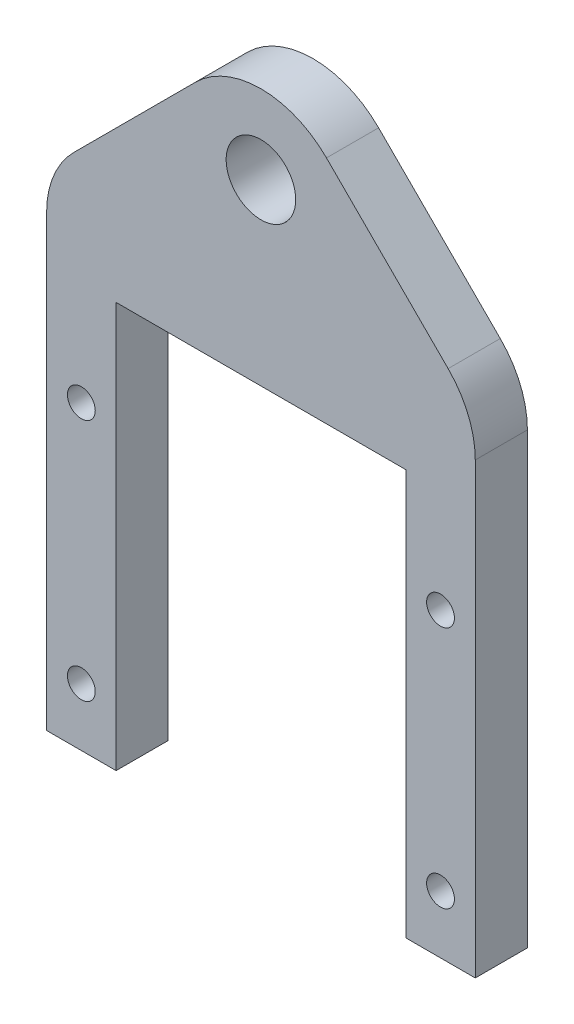
ISO-10303-21;
HEADER;
FILE_DESCRIPTION(('STEP AP214'),'2;1');
FILE_NAME('part.step','',(''),(''),'','','');
FILE_SCHEMA(('AUTOMOTIVE_DESIGN { 1 0 10303 214 1 1 1 1 }'));
ENDSEC;
DATA;
#1=APPLICATION_CONTEXT('core data for automotive mechanical design processes');
#2=APPLICATION_PROTOCOL_DEFINITION('international standard','automotive_design',2000,#1);
#3=PRODUCT_CONTEXT('',#1,'mechanical');
#4=PRODUCT('Part','Part','',(#3));
#5=PRODUCT_RELATED_PRODUCT_CATEGORY('part','',(#4));
#6=PRODUCT_DEFINITION_FORMATION('','',#4);
#7=PRODUCT_DEFINITION_CONTEXT('part definition',#1,'design');
#8=PRODUCT_DEFINITION('design','',#6,#7);
#9=PRODUCT_DEFINITION_SHAPE('','',#8);
#10=(LENGTH_UNIT() NAMED_UNIT(*) SI_UNIT(.MILLI.,.METRE.));
#11=(NAMED_UNIT(*) PLANE_ANGLE_UNIT() SI_UNIT($,.RADIAN.));
#12=(NAMED_UNIT(*) SI_UNIT($,.STERADIAN.) SOLID_ANGLE_UNIT());
#13=UNCERTAINTY_MEASURE_WITH_UNIT(LENGTH_MEASURE(1.E-05),#10,'distance_accuracy_value','');
#14=(GEOMETRIC_REPRESENTATION_CONTEXT(3) GLOBAL_UNCERTAINTY_ASSIGNED_CONTEXT((#13)) GLOBAL_UNIT_ASSIGNED_CONTEXT((#10,
#11,#12)) REPRESENTATION_CONTEXT('',''));
#15=CARTESIAN_POINT('',(0.,0.,0.));
#16=DIRECTION('',(0.,0.,1.));
#17=DIRECTION('',(1.,0.,0.));
#18=AXIS2_PLACEMENT_3D('',#15,#16,#17);
#19=CARTESIAN_POINT('',(0.,0.,4.5));
#20=DIRECTION('',(0.,0.,-1.));
#21=DIRECTION('',(-1.,0.,0.));
#22=AXIS2_PLACEMENT_3D('',#19,#20,#21);
#23=PLANE('',#22);
#24=DIRECTION('',(-0.707106781186547,-0.707106781186548,0.));
#25=VECTOR('',#24,1.);
#26=CARTESIAN_POINT('',(-18.5,42.034916596463,4.5));
#27=LINE('',#26,#25);
#28=CARTESIAN_POINT('',(-5.65685424949239,54.8780623469706,4.5));
#29=VERTEX_POINT('',#28);
#30=CARTESIAN_POINT('',(-16.1568542494924,44.3780623469706,4.5));
#31=VERTEX_POINT('',#30);
#32=EDGE_CURVE('E227',#29,#31,#27,.T.);
#33=ORIENTED_EDGE('',*,*,#32,.T.);
#34=CARTESIAN_POINT('',(-10.5,38.7212080974782,4.5));
#35=DIRECTION('',(0.,0.,-1.));
#36=DIRECTION('',(-1.,0.,0.));
#37=AXIS2_PLACEMENT_3D('',#34,#35,#36);
#38=CIRCLE('',#37,8.);
#39=CARTESIAN_POINT('',(-18.5,38.7212080974782,4.5));
#40=VERTEX_POINT('',#39);
#41=EDGE_CURVE('E172',#31,#40,#38,.F.);
#42=ORIENTED_EDGE('',*,*,#41,.T.);
#43=DIRECTION('',(0.,-1.,0.));
#44=VECTOR('',#43,1.);
#45=CARTESIAN_POINT('',(-18.5,0.,4.5));
#46=LINE('',#45,#44);
#47=CARTESIAN_POINT('',(-18.5,0.,4.5));
#48=VERTEX_POINT('',#47);
#49=EDGE_CURVE('E225',#40,#48,#46,.T.);
#50=ORIENTED_EDGE('',*,*,#49,.T.);
#51=DIRECTION('',(1.,0.,0.));
#52=VECTOR('',#51,1.);
#53=CARTESIAN_POINT('',(-12.5,0.,4.5));
#54=LINE('',#53,#52);
#55=CARTESIAN_POINT('',(-12.5,0.,4.5));
#56=VERTEX_POINT('',#55);
#57=EDGE_CURVE('E141',#48,#56,#54,.T.);
#58=ORIENTED_EDGE('',*,*,#57,.T.);
#59=DIRECTION('',(0.,1.,0.));
#60=VECTOR('',#59,1.);
#61=CARTESIAN_POINT('',(-12.5,0.,4.5));
#62=LINE('',#61,#60);
#63=CARTESIAN_POINT('',(-12.5,35.,4.5));
#64=VERTEX_POINT('',#63);
#65=EDGE_CURVE('E135',#56,#64,#62,.T.);
#66=ORIENTED_EDGE('',*,*,#65,.T.);
#67=DIRECTION('',(1.,0.,0.));
#68=VECTOR('',#67,1.);
#69=CARTESIAN_POINT('',(-12.5,35.,4.5));
#70=LINE('',#69,#68);
#71=CARTESIAN_POINT('',(12.5,35.,4.5));
#72=VERTEX_POINT('',#71);
#73=EDGE_CURVE('E125',#64,#72,#70,.T.);
#74=ORIENTED_EDGE('',*,*,#73,.T.);
#75=DIRECTION('',(0.,-1.,0.));
#76=VECTOR('',#75,1.);
#77=CARTESIAN_POINT('',(12.5,0.,4.5));
#78=LINE('',#77,#76);
#79=CARTESIAN_POINT('',(12.5,0.,4.5));
#80=VERTEX_POINT('',#79);
#81=EDGE_CURVE('E134',#72,#80,#78,.T.);
#82=ORIENTED_EDGE('',*,*,#81,.T.);
#83=DIRECTION('',(1.,0.,0.));
#84=VECTOR('',#83,1.);
#85=CARTESIAN_POINT('',(18.5,0.,4.5));
#86=LINE('',#85,#84);
#87=CARTESIAN_POINT('',(18.5,0.,4.5));
#88=VERTEX_POINT('',#87);
#89=EDGE_CURVE('E214',#80,#88,#86,.T.);
#90=ORIENTED_EDGE('',*,*,#89,.T.);
#91=DIRECTION('',(0.,1.,0.));
#92=VECTOR('',#91,1.);
#93=CARTESIAN_POINT('',(18.5,42.034916596463,4.5));
#94=LINE('',#93,#92);
#95=CARTESIAN_POINT('',(18.5,38.7212080974782,4.5));
#96=VERTEX_POINT('',#95);
#97=EDGE_CURVE('E230',#88,#96,#94,.T.);
#98=ORIENTED_EDGE('',*,*,#97,.T.);
#99=CARTESIAN_POINT('',(10.5,38.7212080974782,4.5));
#100=DIRECTION('',(0.,0.,-1.));
#101=DIRECTION('',(-1.,0.,0.));
#102=AXIS2_PLACEMENT_3D('',#99,#100,#101);
#103=CIRCLE('',#102,8.);
#104=CARTESIAN_POINT('',(16.1568542494924,44.3780623469706,4.5));
#105=VERTEX_POINT('',#104);
#106=EDGE_CURVE('E57',#96,#105,#103,.F.);
#107=ORIENTED_EDGE('',*,*,#106,.T.);
#108=DIRECTION('',(-0.707106781186547,0.707106781186548,0.));
#109=VECTOR('',#108,1.);
#110=CARTESIAN_POINT('',(0.,60.534916596463,4.5));
#111=LINE('',#110,#109);
#112=CARTESIAN_POINT('',(5.65685424949239,54.8780623469706,4.5));
#113=VERTEX_POINT('',#112);
#114=EDGE_CURVE('E179',#105,#113,#111,.T.);
#115=ORIENTED_EDGE('',*,*,#114,.T.);
#116=CARTESIAN_POINT('',(0.,49.2212080974782,4.5));
#117=DIRECTION('',(0.,0.,-1.));
#118=DIRECTION('',(-1.,0.,0.));
#119=AXIS2_PLACEMENT_3D('',#116,#117,#118);
#120=CIRCLE('',#119,8.);
#121=EDGE_CURVE('E169',#113,#29,#120,.F.);
#122=ORIENTED_EDGE('',*,*,#121,.T.);
#123=EDGE_LOOP('',(#33,#42,#50,#58,#66,#74,#82,#90,#98,#107,#115,#122));
#124=FACE_BOUND('',#123,.T.);
#125=CARTESIAN_POINT('',(-15.5,26.,4.5));
#126=DIRECTION('',(0.,0.,1.));
#127=DIRECTION('',(1.,0.,0.));
#128=AXIS2_PLACEMENT_3D('',#125,#126,#127);
#129=CIRCLE('',#128,1.2);
#130=CARTESIAN_POINT('',(-14.3,26.,4.5));
#131=VERTEX_POINT('',#130);
#132=EDGE_CURVE('E223',#131,#131,#129,.T.);
#133=ORIENTED_EDGE('',*,*,#132,.F.);
#134=EDGE_LOOP('',(#133));
#135=FACE_BOUND('',#134,.T.);
#136=CARTESIAN_POINT('',(-15.5,5.,4.5));
#137=DIRECTION('',(0.,0.,1.));
#138=DIRECTION('',(1.,0.,0.));
#139=AXIS2_PLACEMENT_3D('',#136,#137,#138);
#140=CIRCLE('',#139,1.2);
#141=CARTESIAN_POINT('',(-14.3,5.,4.5));
#142=VERTEX_POINT('',#141);
#143=EDGE_CURVE('E237',#142,#142,#140,.T.);
#144=ORIENTED_EDGE('',*,*,#143,.F.);
#145=EDGE_LOOP('',(#144));
#146=FACE_BOUND('',#145,.T.);
#147=CARTESIAN_POINT('',(15.5,5.,4.5));
#148=DIRECTION('',(0.,0.,1.));
#149=DIRECTION('',(-1.,0.,0.));
#150=AXIS2_PLACEMENT_3D('',#147,#148,#149);
#151=CIRCLE('',#150,1.2);
#152=CARTESIAN_POINT('',(14.3,5.,4.5));
#153=VERTEX_POINT('',#152);
#154=EDGE_CURVE('E243',#153,#153,#151,.T.);
#155=ORIENTED_EDGE('',*,*,#154,.F.);
#156=EDGE_LOOP('',(#155));
#157=FACE_BOUND('',#156,.T.);
#158=CARTESIAN_POINT('',(0.,50.4213975565305,4.5));
#159=DIRECTION('',(0.,0.,1.));
#160=DIRECTION('',(1.,0.,0.));
#161=AXIS2_PLACEMENT_3D('',#158,#159,#160);
#162=CIRCLE('',#161,3.);
#163=CARTESIAN_POINT('',(3.,50.4213975565305,4.5));
#164=VERTEX_POINT('',#163);
#165=EDGE_CURVE('E249',#164,#164,#162,.T.);
#166=ORIENTED_EDGE('',*,*,#165,.F.);
#167=EDGE_LOOP('',(#166));
#168=FACE_BOUND('',#167,.T.);
#169=CARTESIAN_POINT('',(15.5,26.,4.5));
#170=DIRECTION('',(0.,0.,1.));
#171=DIRECTION('',(-1.,0.,0.));
#172=AXIS2_PLACEMENT_3D('',#169,#170,#171);
#173=CIRCLE('',#172,1.2);
#174=CARTESIAN_POINT('',(14.3,26.,4.5));
#175=VERTEX_POINT('',#174);
#176=EDGE_CURVE('E255',#175,#175,#173,.T.);
#177=ORIENTED_EDGE('',*,*,#176,.F.);
#178=EDGE_LOOP('',(#177));
#179=FACE_BOUND('',#178,.T.);
#180=ADVANCED_FACE('F35',(#124,#135,#146,#157,#168,#179),#23,.F.);
#181=CARTESIAN_POINT('',(0.,0.,0.));
#182=DIRECTION('',(0.,0.,-1.));
#183=DIRECTION('',(-1.,0.,0.));
#184=AXIS2_PLACEMENT_3D('',#181,#182,#183);
#185=PLANE('',#184);
#186=CARTESIAN_POINT('',(0.,50.4213975565305,0.));
#187=DIRECTION('',(0.,0.,1.));
#188=DIRECTION('',(1.,0.,0.));
#189=AXIS2_PLACEMENT_3D('',#186,#187,#188);
#190=CIRCLE('',#189,3.);
#191=CARTESIAN_POINT('',(3.,50.4213975565305,0.));
#192=VERTEX_POINT('',#191);
#193=EDGE_CURVE('E252',#192,#192,#190,.T.);
#194=ORIENTED_EDGE('',*,*,#193,.T.);
#195=EDGE_LOOP('',(#194));
#196=FACE_BOUND('',#195,.T.);
#197=CARTESIAN_POINT('',(-15.5,5.,0.));
#198=DIRECTION('',(0.,0.,1.));
#199=DIRECTION('',(1.,0.,0.));
#200=AXIS2_PLACEMENT_3D('',#197,#198,#199);
#201=CIRCLE('',#200,1.2);
#202=CARTESIAN_POINT('',(-14.3,5.,0.));
#203=VERTEX_POINT('',#202);
#204=EDGE_CURVE('E240',#203,#203,#201,.T.);
#205=ORIENTED_EDGE('',*,*,#204,.T.);
#206=EDGE_LOOP('',(#205));
#207=FACE_BOUND('',#206,.T.);
#208=DIRECTION('',(0.,-1.,0.));
#209=VECTOR('',#208,1.);
#210=CARTESIAN_POINT('',(-18.5,0.,0.));
#211=LINE('',#210,#209);
#212=CARTESIAN_POINT('',(-18.5,38.7212080974782,0.));
#213=VERTEX_POINT('',#212);
#214=CARTESIAN_POINT('',(-18.5,0.,0.));
#215=VERTEX_POINT('',#214);
#216=EDGE_CURVE('E192',#213,#215,#211,.T.);
#217=ORIENTED_EDGE('',*,*,#216,.F.);
#218=CARTESIAN_POINT('',(-10.5,38.7212080974782,0.));
#219=DIRECTION('',(0.,0.,-1.));
#220=DIRECTION('',(-1.,0.,0.));
#221=AXIS2_PLACEMENT_3D('',#218,#219,#220);
#222=CIRCLE('',#221,8.);
#223=CARTESIAN_POINT('',(-16.1568542494924,44.3780623469706,0.));
#224=VERTEX_POINT('',#223);
#225=EDGE_CURVE('E162',#213,#224,#222,.T.);
#226=ORIENTED_EDGE('',*,*,#225,.T.);
#227=DIRECTION('',(-0.707106781186547,-0.707106781186548,0.));
#228=VECTOR('',#227,1.);
#229=CARTESIAN_POINT('',(-18.5,42.034916596463,0.));
#230=LINE('',#229,#228);
#231=CARTESIAN_POINT('',(-5.65685424949239,54.8780623469706,0.));
#232=VERTEX_POINT('',#231);
#233=EDGE_CURVE('E188',#232,#224,#230,.T.);
#234=ORIENTED_EDGE('',*,*,#233,.F.);
#235=CARTESIAN_POINT('',(0.,49.2212080974782,0.));
#236=DIRECTION('',(0.,0.,-1.));
#237=DIRECTION('',(-1.,0.,0.));
#238=AXIS2_PLACEMENT_3D('',#235,#236,#237);
#239=CIRCLE('',#238,8.);
#240=CARTESIAN_POINT('',(5.65685424949239,54.8780623469706,0.));
#241=VERTEX_POINT('',#240);
#242=EDGE_CURVE('E153',#232,#241,#239,.T.);
#243=ORIENTED_EDGE('',*,*,#242,.T.);
#244=DIRECTION('',(-0.707106781186547,0.707106781186548,0.));
#245=VECTOR('',#244,1.);
#246=CARTESIAN_POINT('',(0.,60.534916596463,0.));
#247=LINE('',#246,#245);
#248=CARTESIAN_POINT('',(16.1568542494924,44.3780623469706,0.));
#249=VERTEX_POINT('',#248);
#250=EDGE_CURVE('E178',#249,#241,#247,.T.);
#251=ORIENTED_EDGE('',*,*,#250,.F.);
#252=CARTESIAN_POINT('',(10.5,38.7212080974782,0.));
#253=DIRECTION('',(0.,0.,-1.));
#254=DIRECTION('',(-1.,0.,0.));
#255=AXIS2_PLACEMENT_3D('',#252,#253,#254);
#256=CIRCLE('',#255,8.);
#257=CARTESIAN_POINT('',(18.5,38.7212080974782,0.));
#258=VERTEX_POINT('',#257);
#259=EDGE_CURVE('E160',#249,#258,#256,.T.);
#260=ORIENTED_EDGE('',*,*,#259,.T.);
#261=DIRECTION('',(0.,1.,0.));
#262=VECTOR('',#261,1.);
#263=CARTESIAN_POINT('',(18.5,42.034916596463,0.));
#264=LINE('',#263,#262);
#265=CARTESIAN_POINT('',(18.5,0.,0.));
#266=VERTEX_POINT('',#265);
#267=EDGE_CURVE('E189',#266,#258,#264,.T.);
#268=ORIENTED_EDGE('',*,*,#267,.F.);
#269=DIRECTION('',(1.,0.,0.));
#270=VECTOR('',#269,1.);
#271=CARTESIAN_POINT('',(18.5,0.,0.));
#272=LINE('',#271,#270);
#273=CARTESIAN_POINT('',(12.5,0.,0.));
#274=VERTEX_POINT('',#273);
#275=EDGE_CURVE('E194',#274,#266,#272,.T.);
#276=ORIENTED_EDGE('',*,*,#275,.F.);
#277=DIRECTION('',(0.,-1.,0.));
#278=VECTOR('',#277,1.);
#279=CARTESIAN_POINT('',(12.5,0.,0.));
#280=LINE('',#279,#278);
#281=CARTESIAN_POINT('',(12.5,35.,0.));
#282=VERTEX_POINT('',#281);
#283=EDGE_CURVE('E217',#282,#274,#280,.T.);
#284=ORIENTED_EDGE('',*,*,#283,.F.);
#285=DIRECTION('',(1.,0.,0.));
#286=VECTOR('',#285,1.);
#287=CARTESIAN_POINT('',(-12.5,35.,0.));
#288=LINE('',#287,#286);
#289=CARTESIAN_POINT('',(-12.5,35.,0.));
#290=VERTEX_POINT('',#289);
#291=EDGE_CURVE('E218',#290,#282,#288,.T.);
#292=ORIENTED_EDGE('',*,*,#291,.F.);
#293=DIRECTION('',(0.,1.,0.));
#294=VECTOR('',#293,1.);
#295=CARTESIAN_POINT('',(-12.5,0.,0.));
#296=LINE('',#295,#294);
#297=CARTESIAN_POINT('',(-12.5,0.,0.));
#298=VERTEX_POINT('',#297);
#299=EDGE_CURVE('E149',#298,#290,#296,.T.);
#300=ORIENTED_EDGE('',*,*,#299,.F.);
#301=DIRECTION('',(1.,0.,0.));
#302=VECTOR('',#301,1.);
#303=CARTESIAN_POINT('',(-12.5,0.,0.));
#304=LINE('',#303,#302);
#305=EDGE_CURVE('E145',#215,#298,#304,.T.);
#306=ORIENTED_EDGE('',*,*,#305,.F.);
#307=EDGE_LOOP('',(#217,#226,#234,#243,#251,#260,#268,#276,#284,#292,#300,#306));
#308=FACE_BOUND('',#307,.T.);
#309=CARTESIAN_POINT('',(-15.5,26.,0.));
#310=DIRECTION('',(0.,0.,1.));
#311=DIRECTION('',(1.,0.,0.));
#312=AXIS2_PLACEMENT_3D('',#309,#310,#311);
#313=CIRCLE('',#312,1.2);
#314=CARTESIAN_POINT('',(-14.3,26.,0.));
#315=VERTEX_POINT('',#314);
#316=EDGE_CURVE('E234',#315,#315,#313,.T.);
#317=ORIENTED_EDGE('',*,*,#316,.T.);
#318=EDGE_LOOP('',(#317));
#319=FACE_BOUND('',#318,.T.);
#320=CARTESIAN_POINT('',(15.5,5.,0.));
#321=DIRECTION('',(0.,0.,1.));
#322=DIRECTION('',(-1.,0.,0.));
#323=AXIS2_PLACEMENT_3D('',#320,#321,#322);
#324=CIRCLE('',#323,1.2);
#325=CARTESIAN_POINT('',(14.3,5.,0.));
#326=VERTEX_POINT('',#325);
#327=EDGE_CURVE('E246',#326,#326,#324,.T.);
#328=ORIENTED_EDGE('',*,*,#327,.T.);
#329=EDGE_LOOP('',(#328));
#330=FACE_BOUND('',#329,.T.);
#331=CARTESIAN_POINT('',(15.5,26.,0.));
#332=DIRECTION('',(0.,0.,1.));
#333=DIRECTION('',(-1.,0.,0.));
#334=AXIS2_PLACEMENT_3D('',#331,#332,#333);
#335=CIRCLE('',#334,1.2);
#336=CARTESIAN_POINT('',(14.3,26.,0.));
#337=VERTEX_POINT('',#336);
#338=EDGE_CURVE('E258',#337,#337,#335,.T.);
#339=ORIENTED_EDGE('',*,*,#338,.T.);
#340=EDGE_LOOP('',(#339));
#341=FACE_BOUND('',#340,.T.);
#342=ADVANCED_FACE('F183',(#196,#207,#308,#319,#330,#341),#185,.T.);
#343=CARTESIAN_POINT('',(-12.5,0.,4.5));
#344=DIRECTION('',(-1.,0.,0.));
#345=DIRECTION('',(0.,0.,1.));
#346=AXIS2_PLACEMENT_3D('',#343,#344,#345);
#347=PLANE('',#346);
#348=ORIENTED_EDGE('',*,*,#299,.T.);
#349=DIRECTION('',(0.,0.,-1.));
#350=VECTOR('',#349,1.);
#351=CARTESIAN_POINT('',(-12.5,35.,4.5));
#352=LINE('',#351,#350);
#353=EDGE_CURVE('E129',#64,#290,#352,.T.);
#354=ORIENTED_EDGE('',*,*,#353,.F.);
#355=ORIENTED_EDGE('',*,*,#65,.F.);
#356=DIRECTION('',(0.,0.,-1.));
#357=VECTOR('',#356,1.);
#358=CARTESIAN_POINT('',(-12.5,0.,4.5));
#359=LINE('',#358,#357);
#360=EDGE_CURVE('E200',#56,#298,#359,.T.);
#361=ORIENTED_EDGE('',*,*,#360,.T.);
#362=EDGE_LOOP('',(#348,#354,#355,#361));
#363=FACE_BOUND('',#362,.T.);
#364=ADVANCED_FACE('F147',(#363),#347,.F.);
#365=CARTESIAN_POINT('',(-12.5,35.,4.5));
#366=DIRECTION('',(0.,1.,0.));
#367=DIRECTION('',(0.,0.,1.));
#368=AXIS2_PLACEMENT_3D('',#365,#366,#367);
#369=PLANE('',#368);
#370=ORIENTED_EDGE('',*,*,#291,.T.);
#371=DIRECTION('',(0.,0.,-1.));
#372=VECTOR('',#371,1.);
#373=CARTESIAN_POINT('',(12.5,35.,4.5));
#374=LINE('',#373,#372);
#375=EDGE_CURVE('E132',#72,#282,#374,.T.);
#376=ORIENTED_EDGE('',*,*,#375,.F.);
#377=ORIENTED_EDGE('',*,*,#73,.F.);
#378=ORIENTED_EDGE('',*,*,#353,.T.);
#379=EDGE_LOOP('',(#370,#376,#377,#378));
#380=FACE_BOUND('',#379,.T.);
#381=ADVANCED_FACE('F127',(#380),#369,.F.);
#382=CARTESIAN_POINT('',(12.5,0.,4.5));
#383=DIRECTION('',(1.,0.,0.));
#384=DIRECTION('',(0.,0.,-1.));
#385=AXIS2_PLACEMENT_3D('',#382,#383,#384);
#386=PLANE('',#385);
#387=ORIENTED_EDGE('',*,*,#283,.T.);
#388=DIRECTION('',(0.,0.,-1.));
#389=VECTOR('',#388,1.);
#390=CARTESIAN_POINT('',(12.5,0.,4.5));
#391=LINE('',#390,#389);
#392=EDGE_CURVE('E155',#80,#274,#391,.T.);
#393=ORIENTED_EDGE('',*,*,#392,.F.);
#394=ORIENTED_EDGE('',*,*,#81,.F.);
#395=ORIENTED_EDGE('',*,*,#375,.T.);
#396=EDGE_LOOP('',(#387,#393,#394,#395));
#397=FACE_BOUND('',#396,.T.);
#398=ADVANCED_FACE('F298',(#397),#386,.F.);
#399=CARTESIAN_POINT('',(18.5,0.,4.5));
#400=DIRECTION('',(0.,1.,0.));
#401=DIRECTION('',(0.,0.,1.));
#402=AXIS2_PLACEMENT_3D('',#399,#400,#401);
#403=PLANE('',#402);
#404=ORIENTED_EDGE('',*,*,#275,.T.);
#405=DIRECTION('',(0.,0.,-1.));
#406=VECTOR('',#405,1.);
#407=CARTESIAN_POINT('',(18.5,0.,4.5));
#408=LINE('',#407,#406);
#409=EDGE_CURVE('E205',#88,#266,#408,.T.);
#410=ORIENTED_EDGE('',*,*,#409,.F.);
#411=ORIENTED_EDGE('',*,*,#89,.F.);
#412=ORIENTED_EDGE('',*,*,#392,.T.);
#413=EDGE_LOOP('',(#404,#410,#411,#412));
#414=FACE_BOUND('',#413,.T.);
#415=ADVANCED_FACE('F212',(#414),#403,.F.);
#416=CARTESIAN_POINT('',(18.5,42.034916596463,4.5));
#417=DIRECTION('',(-1.,0.,0.));
#418=DIRECTION('',(0.,-1.,0.));
#419=AXIS2_PLACEMENT_3D('',#416,#417,#418);
#420=PLANE('',#419);
#421=ORIENTED_EDGE('',*,*,#267,.T.);
#422=DIRECTION('',(0.,0.,-1.));
#423=VECTOR('',#422,1.);
#424=CARTESIAN_POINT('',(18.5,38.7212080974782,4.5));
#425=LINE('',#424,#423);
#426=EDGE_CURVE('E11',#258,#96,#425,.F.);
#427=ORIENTED_EDGE('',*,*,#426,.T.);
#428=ORIENTED_EDGE('',*,*,#97,.F.);
#429=ORIENTED_EDGE('',*,*,#409,.T.);
#430=EDGE_LOOP('',(#421,#427,#428,#429));
#431=FACE_BOUND('',#430,.T.);
#432=ADVANCED_FACE('F292',(#431),#420,.F.);
#433=CARTESIAN_POINT('',(0.,60.534916596463,4.5));
#434=DIRECTION('',(-0.707106781186548,-0.707106781186547,0.));
#435=DIRECTION('',(0.707106781186547,-0.707106781186548,0.));
#436=AXIS2_PLACEMENT_3D('',#433,#434,#435);
#437=PLANE('',#436);
#438=ORIENTED_EDGE('',*,*,#114,.F.);
#439=DIRECTION('',(0.,0.,-1.));
#440=VECTOR('',#439,1.);
#441=CARTESIAN_POINT('',(16.1568542494924,44.3780623469706,4.5));
#442=LINE('',#441,#440);
#443=EDGE_CURVE('E43',#105,#249,#442,.T.);
#444=ORIENTED_EDGE('',*,*,#443,.T.);
#445=ORIENTED_EDGE('',*,*,#250,.T.);
#446=DIRECTION('',(0.,0.,-1.));
#447=VECTOR('',#446,1.);
#448=CARTESIAN_POINT('',(5.65685424949239,54.8780623469706,4.5));
#449=LINE('',#448,#447);
#450=EDGE_CURVE('E50',#241,#113,#449,.F.);
#451=ORIENTED_EDGE('',*,*,#450,.T.);
#452=EDGE_LOOP('',(#438,#444,#445,#451));
#453=FACE_BOUND('',#452,.T.);
#454=ADVANCED_FACE('F177',(#453),#437,.F.);
#455=CARTESIAN_POINT('',(-18.5,42.034916596463,4.5));
#456=DIRECTION('',(0.707106781186548,-0.707106781186547,0.));
#457=DIRECTION('',(0.707106781186547,0.707106781186548,0.));
#458=AXIS2_PLACEMENT_3D('',#455,#456,#457);
#459=PLANE('',#458);
#460=ORIENTED_EDGE('',*,*,#233,.T.);
#461=DIRECTION('',(0.,0.,-1.));
#462=VECTOR('',#461,1.);
#463=CARTESIAN_POINT('',(-16.1568542494924,44.3780623469706,4.5));
#464=LINE('',#463,#462);
#465=EDGE_CURVE('E167',#224,#31,#464,.F.);
#466=ORIENTED_EDGE('',*,*,#465,.T.);
#467=ORIENTED_EDGE('',*,*,#32,.F.);
#468=DIRECTION('',(0.,0.,-1.));
#469=VECTOR('',#468,1.);
#470=CARTESIAN_POINT('',(-5.65685424949238,54.8780623469706,4.5));
#471=LINE('',#470,#469);
#472=EDGE_CURVE('E164',#29,#232,#471,.T.);
#473=ORIENTED_EDGE('',*,*,#472,.T.);
#474=EDGE_LOOP('',(#460,#466,#467,#473));
#475=FACE_BOUND('',#474,.T.);
#476=ADVANCED_FACE('F285',(#475),#459,.F.);
#477=CARTESIAN_POINT('',(-18.5,0.,4.5));
#478=DIRECTION('',(1.,0.,0.));
#479=DIRECTION('',(0.,0.,-1.));
#480=AXIS2_PLACEMENT_3D('',#477,#478,#479);
#481=PLANE('',#480);
#482=ORIENTED_EDGE('',*,*,#49,.F.);
#483=DIRECTION('',(0.,0.,-1.));
#484=VECTOR('',#483,1.);
#485=CARTESIAN_POINT('',(-18.5,38.7212080974782,4.5));
#486=LINE('',#485,#484);
#487=EDGE_CURVE('E150',#40,#213,#486,.T.);
#488=ORIENTED_EDGE('',*,*,#487,.T.);
#489=ORIENTED_EDGE('',*,*,#216,.T.);
#490=DIRECTION('',(0.,0.,-1.));
#491=VECTOR('',#490,1.);
#492=CARTESIAN_POINT('',(-18.5,0.,4.5));
#493=LINE('',#492,#491);
#494=EDGE_CURVE('E202',#48,#215,#493,.T.);
#495=ORIENTED_EDGE('',*,*,#494,.F.);
#496=EDGE_LOOP('',(#482,#488,#489,#495));
#497=FACE_BOUND('',#496,.T.);
#498=ADVANCED_FACE('F281',(#497),#481,.F.);
#499=CARTESIAN_POINT('',(-12.5,0.,4.5));
#500=DIRECTION('',(0.,1.,0.));
#501=DIRECTION('',(0.,0.,1.));
#502=AXIS2_PLACEMENT_3D('',#499,#500,#501);
#503=PLANE('',#502);
#504=ORIENTED_EDGE('',*,*,#305,.T.);
#505=ORIENTED_EDGE('',*,*,#360,.F.);
#506=ORIENTED_EDGE('',*,*,#57,.F.);
#507=ORIENTED_EDGE('',*,*,#494,.T.);
#508=EDGE_LOOP('',(#504,#505,#506,#507));
#509=FACE_BOUND('',#508,.T.);
#510=ADVANCED_FACE('F278',(#509),#503,.F.);
#511=CARTESIAN_POINT('',(-15.5,26.,4.5));
#512=DIRECTION('',(0.,0.,-1.));
#513=DIRECTION('',(-1.,0.,0.));
#514=AXIS2_PLACEMENT_3D('',#511,#512,#513);
#515=CYLINDRICAL_SURFACE('',#514,1.2);
#516=ORIENTED_EDGE('',*,*,#132,.T.);
#517=EDGE_LOOP('',(#516));
#518=FACE_BOUND('',#517,.T.);
#519=ORIENTED_EDGE('',*,*,#316,.F.);
#520=EDGE_LOOP('',(#519));
#521=FACE_BOUND('',#520,.T.);
#522=ADVANCED_FACE('F275',(#518,#521),#515,.F.);
#523=CARTESIAN_POINT('',(-15.5,5.,4.5));
#524=DIRECTION('',(0.,0.,-1.));
#525=DIRECTION('',(-1.,0.,0.));
#526=AXIS2_PLACEMENT_3D('',#523,#524,#525);
#527=CYLINDRICAL_SURFACE('',#526,1.2);
#528=ORIENTED_EDGE('',*,*,#143,.T.);
#529=EDGE_LOOP('',(#528));
#530=FACE_BOUND('',#529,.T.);
#531=ORIENTED_EDGE('',*,*,#204,.F.);
#532=EDGE_LOOP('',(#531));
#533=FACE_BOUND('',#532,.T.);
#534=ADVANCED_FACE('F402',(#530,#533),#527,.F.);
#535=CARTESIAN_POINT('',(15.5,5.,4.5));
#536=DIRECTION('',(0.,0.,-1.));
#537=DIRECTION('',(-1.,0.,0.));
#538=AXIS2_PLACEMENT_3D('',#535,#536,#537);
#539=CYLINDRICAL_SURFACE('',#538,1.2);
#540=ORIENTED_EDGE('',*,*,#154,.T.);
#541=EDGE_LOOP('',(#540));
#542=FACE_BOUND('',#541,.T.);
#543=ORIENTED_EDGE('',*,*,#327,.F.);
#544=EDGE_LOOP('',(#543));
#545=FACE_BOUND('',#544,.T.);
#546=ADVANCED_FACE('F392',(#542,#545),#539,.F.);
#547=CARTESIAN_POINT('',(0.,50.4213975565305,4.5));
#548=DIRECTION('',(0.,0.,-1.));
#549=DIRECTION('',(-1.,0.,0.));
#550=AXIS2_PLACEMENT_3D('',#547,#548,#549);
#551=CYLINDRICAL_SURFACE('',#550,3.);
#552=ORIENTED_EDGE('',*,*,#165,.T.);
#553=EDGE_LOOP('',(#552));
#554=FACE_BOUND('',#553,.T.);
#555=ORIENTED_EDGE('',*,*,#193,.F.);
#556=EDGE_LOOP('',(#555));
#557=FACE_BOUND('',#556,.T.);
#558=ADVANCED_FACE('F383',(#554,#557),#551,.F.);
#559=CARTESIAN_POINT('',(15.5,26.,4.5));
#560=DIRECTION('',(0.,0.,-1.));
#561=DIRECTION('',(-1.,0.,0.));
#562=AXIS2_PLACEMENT_3D('',#559,#560,#561);
#563=CYLINDRICAL_SURFACE('',#562,1.2);
#564=ORIENTED_EDGE('',*,*,#176,.T.);
#565=EDGE_LOOP('',(#564));
#566=FACE_BOUND('',#565,.T.);
#567=ORIENTED_EDGE('',*,*,#338,.F.);
#568=EDGE_LOOP('',(#567));
#569=FACE_BOUND('',#568,.T.);
#570=ADVANCED_FACE('F264',(#566,#569),#563,.F.);
#571=CARTESIAN_POINT('',(-10.5,38.7212080974782,4.5));
#572=DIRECTION('',(0.,0.,-1.));
#573=DIRECTION('',(-1.,0.,0.));
#574=AXIS2_PLACEMENT_3D('',#571,#572,#573);
#575=CYLINDRICAL_SURFACE('',#574,8.);
#576=ORIENTED_EDGE('',*,*,#41,.F.);
#577=ORIENTED_EDGE('',*,*,#465,.F.);
#578=ORIENTED_EDGE('',*,*,#225,.F.);
#579=ORIENTED_EDGE('',*,*,#487,.F.);
#580=EDGE_LOOP('',(#576,#577,#578,#579));
#581=FACE_BOUND('',#580,.T.);
#582=ADVANCED_FACE('F305',(#581),#575,.T.);
#583=CARTESIAN_POINT('',(10.5,38.7212080974782,4.5));
#584=DIRECTION('',(0.,0.,-1.));
#585=DIRECTION('',(-1.,0.,0.));
#586=AXIS2_PLACEMENT_3D('',#583,#584,#585);
#587=CYLINDRICAL_SURFACE('',#586,8.);
#588=ORIENTED_EDGE('',*,*,#106,.F.);
#589=ORIENTED_EDGE('',*,*,#426,.F.);
#590=ORIENTED_EDGE('',*,*,#259,.F.);
#591=ORIENTED_EDGE('',*,*,#443,.F.);
#592=EDGE_LOOP('',(#588,#589,#590,#591));
#593=FACE_BOUND('',#592,.T.);
#594=ADVANCED_FACE('F307',(#593),#587,.T.);
#595=CARTESIAN_POINT('',(0.,49.2212080974782,4.5));
#596=DIRECTION('',(0.,0.,-1.));
#597=DIRECTION('',(-1.,0.,0.));
#598=AXIS2_PLACEMENT_3D('',#595,#596,#597);
#599=CYLINDRICAL_SURFACE('',#598,8.);
#600=ORIENTED_EDGE('',*,*,#121,.F.);
#601=ORIENTED_EDGE('',*,*,#450,.F.);
#602=ORIENTED_EDGE('',*,*,#242,.F.);
#603=ORIENTED_EDGE('',*,*,#472,.F.);
#604=EDGE_LOOP('',(#600,#601,#602,#603));
#605=FACE_BOUND('',#604,.T.);
#606=ADVANCED_FACE('F37',(#605),#599,.T.);
#607=CLOSED_SHELL('',(#180,#342,#364,#381,#398,#415,#432,#454,#476,#498,#510,#522,#534,#546,
#558,#570,#582,#594,#606));
#608=MANIFOLD_SOLID_BREP('B2',#607);
#609=ADVANCED_BREP_SHAPE_REPRESENTATION('',(#18,#608),#14);
#610=SHAPE_DEFINITION_REPRESENTATION(#9,#609);
ENDSEC;
END-ISO-10303-21;
